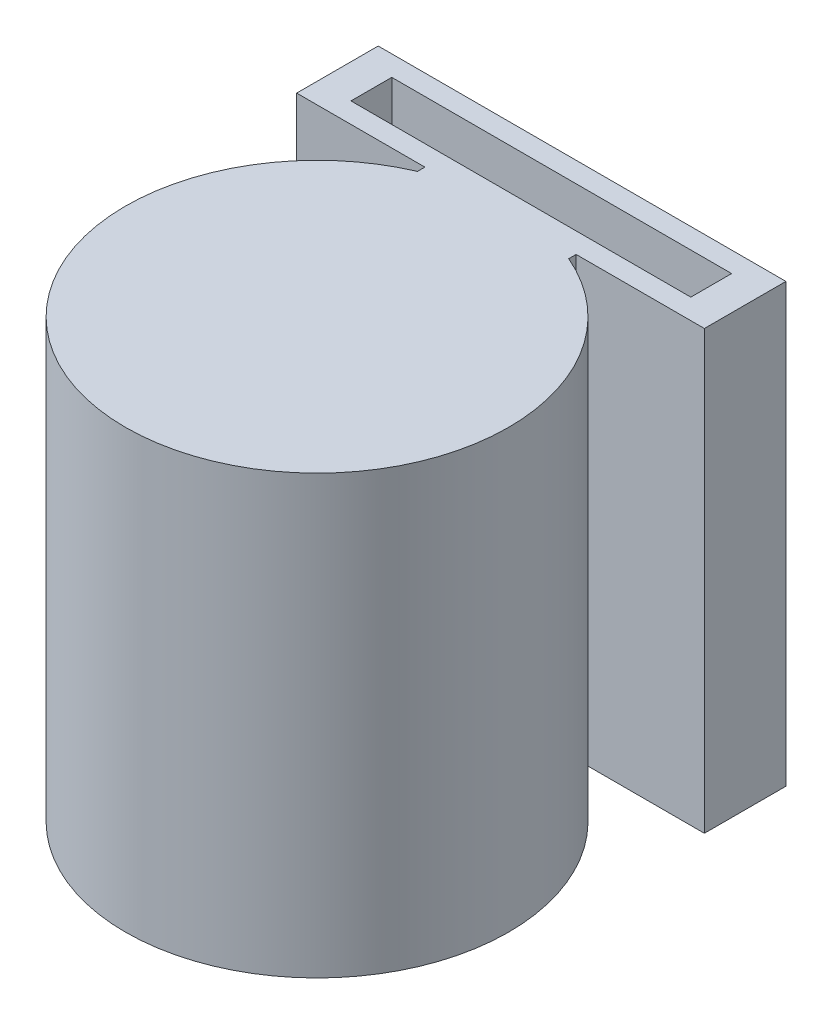
ISO-10303-21;
HEADER;
FILE_DESCRIPTION(('STEP AP214'),'2;1');
FILE_NAME('part.step','',(''),(''),'','','');
FILE_SCHEMA(('AUTOMOTIVE_DESIGN { 1 0 10303 214 1 1 1 1 }'));
ENDSEC;
DATA;
#1=APPLICATION_CONTEXT('core data for automotive mechanical design processes');
#2=APPLICATION_PROTOCOL_DEFINITION('international standard','automotive_design',2000,#1);
#3=PRODUCT_CONTEXT('',#1,'mechanical');
#4=PRODUCT('Part','Part','',(#3));
#5=PRODUCT_RELATED_PRODUCT_CATEGORY('part','',(#4));
#6=PRODUCT_DEFINITION_FORMATION('','',#4);
#7=PRODUCT_DEFINITION_CONTEXT('part definition',#1,'design');
#8=PRODUCT_DEFINITION('design','',#6,#7);
#9=PRODUCT_DEFINITION_SHAPE('','',#8);
#10=(LENGTH_UNIT() NAMED_UNIT(*) SI_UNIT(.MILLI.,.METRE.));
#11=(NAMED_UNIT(*) PLANE_ANGLE_UNIT() SI_UNIT($,.RADIAN.));
#12=(NAMED_UNIT(*) SI_UNIT($,.STERADIAN.) SOLID_ANGLE_UNIT());
#13=UNCERTAINTY_MEASURE_WITH_UNIT(LENGTH_MEASURE(1.E-05),#10,'distance_accuracy_value','');
#14=(GEOMETRIC_REPRESENTATION_CONTEXT(3) GLOBAL_UNCERTAINTY_ASSIGNED_CONTEXT((#13)) GLOBAL_UNIT_ASSIGNED_CONTEXT((#10,
#11,#12)) REPRESENTATION_CONTEXT('',''));
#15=CARTESIAN_POINT('',(0.,0.,0.));
#16=DIRECTION('',(0.,0.,1.));
#17=DIRECTION('',(1.,0.,0.));
#18=AXIS2_PLACEMENT_3D('',#15,#16,#17);
#19=CARTESIAN_POINT('',(0.,-72.0463985530224,-8.4996878151237));
#20=DIRECTION('',(0.,1.,0.));
#21=DIRECTION('',(0.,0.,1.));
#22=AXIS2_PLACEMENT_3D('',#19,#20,#21);
#23=CYLINDRICAL_SURFACE('',#22,13.1);
#24=CARTESIAN_POINT('',(0.,-13.5003121848763,-8.49968781512369));
#25=DIRECTION('',(0.,-0.707106781186549,-0.707106781186546));
#26=DIRECTION('',(0.,0.707106781186546,-0.707106781186549));
#27=AXIS2_PLACEMENT_3D('',#24,#25,#26);
#28=ELLIPSE('',#27,18.5261976670875,13.1);
#29=CARTESIAN_POINT('',(0.,-0.400312184876321,-21.5996878151237));
#30=VERTEX_POINT('',#29);
#31=EDGE_CURVE('E178',#30,#30,#28,.F.);
#32=ORIENTED_EDGE('',*,*,#31,.T.);
#33=EDGE_LOOP('',(#32));
#34=FACE_BOUND('',#33,.T.);
#35=CARTESIAN_POINT('',(0.,-32.17,-8.49968781512369));
#36=DIRECTION('',(0.,1.,0.));
#37=DIRECTION('',(0.,0.,1.));
#38=AXIS2_PLACEMENT_3D('',#35,#36,#37);
#39=CIRCLE('',#38,13.1);
#40=CARTESIAN_POINT('',(0.,-32.17,4.6003121848763));
#41=VERTEX_POINT('',#40);
#42=EDGE_CURVE('E173',#41,#41,#39,.F.);
#43=ORIENTED_EDGE('',*,*,#42,.T.);
#44=EDGE_LOOP('',(#43));
#45=FACE_BOUND('',#44,.T.);
#46=CARTESIAN_POINT('',(-5.,-17.33,-20.60794945749));
#47=CARTESIAN_POINT('',(-5.00000077299546,-17.4647773456957,-20.607948739692));
#48=CARTESIAN_POINT('',(-4.9945461523741,-17.5995444223365,-20.6102057827907));
#49=CARTESIAN_POINT('',(-4.97278621917224,-17.8680974508143,-20.6191571648665));
#50=CARTESIAN_POINT('',(-4.95647746997702,-18.0018830783386,-20.6258529092147));
#51=CARTESIAN_POINT('',(-4.91318889956214,-18.2673669819356,-20.6434565024935));
#52=CARTESIAN_POINT('',(-4.88621397751475,-18.3990661874963,-20.6543624175598));
#53=CARTESIAN_POINT('',(-4.82185442604891,-18.6595600603921,-20.6800375166632));
#54=CARTESIAN_POINT('',(-4.7844656666146,-18.7883535534012,-20.6948082332978));
#55=CARTESIAN_POINT('',(-4.6997496569164,-19.0417662998117,-20.7277051915014));
#56=CARTESIAN_POINT('',(-4.65245171248173,-19.1663966326081,-20.7458215202995));
#57=CARTESIAN_POINT('',(-4.54825389571227,-19.4111301803324,-20.7849017352215));
#58=CARTESIAN_POINT('',(-4.49135044450513,-19.5312316874058,-20.8058666821292));
#59=CARTESIAN_POINT('',(-4.30686065373591,-19.8836529451058,-20.8721587819417));
#60=CARTESIAN_POINT('',(-4.16543364831012,-20.1082712473746,-20.9209081415289));
#61=CARTESIAN_POINT('',(-3.84214834508918,-20.5416199812969,-21.0247836129367));
#62=CARTESIAN_POINT('',(-3.65870584283882,-20.7491124759798,-21.0801015024587));
#63=CARTESIAN_POINT('',(-3.25972286044259,-21.1313684093332,-21.1893224896178));
#64=CARTESIAN_POINT('',(-3.04417523214753,-21.3061245396978,-21.2432252690313));
#65=CARTESIAN_POINT('',(-2.69671701862042,-21.5428825268322,-21.3196936329052));
#66=CARTESIAN_POINT('',(-2.57453178361095,-21.6186491609927,-21.344847227288));
#67=CARTESIAN_POINT('',(-2.3237202457563,-21.7595574826825,-21.3925766406471));
#68=CARTESIAN_POINT('',(-2.1950965627914,-21.8247034466835,-21.4151534960578));
#69=CARTESIAN_POINT('',(-1.93224676155956,-21.9438110912984,-21.4570850818594));
#70=CARTESIAN_POINT('',(-1.79801981911725,-21.9977711195758,-21.4764393361391));
#71=CARTESIAN_POINT('',(-1.52500788719585,-22.0939565521357,-21.5113469202944));
#72=CARTESIAN_POINT('',(-1.38622510327827,-22.136187543632,-21.5269020594793));
#73=CARTESIAN_POINT('',(-1.11133159835551,-22.2069034577756,-21.553160852373));
#74=CARTESIAN_POINT('',(-0.975373196421513,-22.2359127134461,-21.5640482959931));
#75=CARTESIAN_POINT('',(-0.701301987739246,-22.2825232848404,-21.581622680507));
#76=CARTESIAN_POINT('',(-0.563190132791965,-22.3001295019587,-21.5883114260989));
#77=CARTESIAN_POINT('',(-0.285848621918882,-22.3237619664135,-21.5973035904533));
#78=CARTESIAN_POINT('',(-0.146619063337853,-22.3297892114485,-21.5996073870435));
#79=CARTESIAN_POINT('',(0.131857643638828,-22.3301998935752,-21.5997640848187));
#80=CARTESIAN_POINT('',(0.271104791342252,-22.3245836974394,-21.5976171262039));
#81=CARTESIAN_POINT('',(0.541359708999124,-22.3023592870198,-21.5891591362184));
#82=CARTESIAN_POINT('',(0.672422626751947,-22.2863317952921,-21.5830681495924));
#83=CARTESIAN_POINT('',(0.932689656740286,-22.2440083487516,-21.5670935980766));
#84=CARTESIAN_POINT('',(1.06189313306385,-22.2177089636883,-21.5572087662691));
#85=CARTESIAN_POINT('',(1.31747559716351,-22.1550972450327,-21.5339012726675));
#86=CARTESIAN_POINT('',(1.44385550047283,-22.118788209505,-21.5204797762278));
#87=CARTESIAN_POINT('',(1.69306621655445,-22.0364591356788,-21.4904264154263));
#88=CARTESIAN_POINT('',(1.81589565925142,-21.9904354040171,-21.4737933302783));
#89=CARTESIAN_POINT('',(2.05894589014105,-21.8883284118166,-21.4374638571149));
#90=CARTESIAN_POINT('',(2.17910418273138,-21.8321106051058,-21.417727033708));
#91=CARTESIAN_POINT('',(2.41426879492418,-21.7105086429354,-21.3758519125847));
#92=CARTESIAN_POINT('',(2.52927323917226,-21.6451211860412,-21.3537127505843));
#93=CARTESIAN_POINT('',(2.86554823973216,-21.4358764686924,-21.2844778396176));
#94=CARTESIAN_POINT('',(3.07824406504821,-21.2788677380166,-21.2345391276102));
#95=CARTESIAN_POINT('',(3.48784985545621,-20.9234581237548,-21.1287198933517));
#96=CARTESIAN_POINT('',(3.68303028020317,-20.7231298789938,-21.0726626704496));
#97=CARTESIAN_POINT('',(4.03778672498311,-20.2921029802661,-20.9632659334704));
#98=CARTESIAN_POINT('',(4.1973531296112,-20.0613961510735,-20.9099271563366));
#99=CARTESIAN_POINT('',(4.40816782560457,-19.6940459550784,-20.835967217222));
#100=CARTESIAN_POINT('',(4.47429739583672,-19.5663806876149,-20.8120732658062));
#101=CARTESIAN_POINT('',(4.59548194699221,-19.3054007288433,-20.7673573415251));
#102=CARTESIAN_POINT('',(4.65054164888725,-19.1720884753005,-20.7465340601242));
#103=CARTESIAN_POINT('',(4.74906656200108,-18.9007352062268,-20.7086663462666));
#104=CARTESIAN_POINT('',(4.79253222624607,-18.7626943756986,-20.6916217661652));
#105=CARTESIAN_POINT('',(4.86740009319177,-18.4829791527084,-20.6619261470531));
#106=CARTESIAN_POINT('',(4.89880827584683,-18.3413065987027,-20.6492729304284));
#107=CARTESIAN_POINT('',(4.94780228246284,-18.0634934438975,-20.6293997032522));
#108=CARTESIAN_POINT('',(4.9660677388611,-17.9274914545818,-20.621913525006));
#109=CARTESIAN_POINT('',(4.99135417821556,-17.6543267328377,-20.6115238525004));
#110=CARTESIAN_POINT('',(4.99838001788397,-17.5171645275172,-20.6086183788965));
#111=CARTESIAN_POINT('',(5.00112119561916,-17.2427128030691,-20.6074864995617));
#112=CARTESIAN_POINT('',(4.99683691642494,-17.1054232884069,-20.6092599354947));
#113=CARTESIAN_POINT('',(4.97700878311543,-16.8318029145489,-20.6174226430078));
#114=CARTESIAN_POINT('',(4.96146516358721,-16.6954720354398,-20.6238118184195));
#115=CARTESIAN_POINT('',(4.92034665278704,-16.4316082429433,-20.640554984866));
#116=CARTESIAN_POINT('',(4.89531397571543,-16.3039770092586,-20.6506940502698));
#117=CARTESIAN_POINT('',(4.83548895508767,-16.0513593845517,-20.674623993707));
#118=CARTESIAN_POINT('',(4.80069337033727,-15.9263738867344,-20.6884160844254));
#119=CARTESIAN_POINT('',(4.68210164901511,-15.5566453096703,-20.7346876182145));
#120=CARTESIAN_POINT('',(4.58406740980101,-15.3169203525938,-20.7720766434285));
#121=CARTESIAN_POINT('',(4.34869272081281,-14.8479821699037,-20.8574798641119));
#122=CARTESIAN_POINT('',(4.20998934249721,-14.6195243803918,-20.9058464767992));
#123=CARTESIAN_POINT('',(3.89865791596385,-14.1881393614822,-21.0071768118298));
#124=CARTESIAN_POINT('',(3.72601707097851,-13.9852218100054,-21.060142264034));
#125=CARTESIAN_POINT('',(3.33805830617867,-13.5967042217657,-21.1689575142761));
#126=CARTESIAN_POINT('',(3.12067387638251,-13.4131351496334,-21.2247665795372));
#127=CARTESIAN_POINT('',(2.77306630528949,-13.1670260129142,-21.3033717566487));
#128=CARTESIAN_POINT('',(2.65353387650317,-13.0898278394756,-21.328735158452));
#129=CARTESIAN_POINT('',(2.40797940352154,-12.945725317763,-21.3770809750498));
#130=CARTESIAN_POINT('',(2.28196016544225,-12.8788165675338,-21.4000644066455));
#131=CARTESIAN_POINT('',(2.02453051594954,-12.7559888043793,-21.4429591484642));
#132=CARTESIAN_POINT('',(1.89313271427099,-12.7000456875947,-21.4628771756344));
#133=CARTESIAN_POINT('',(1.625645419099,-12.5994948976204,-21.4991293008321));
#134=CARTESIAN_POINT('',(1.48955792384233,-12.5548824627227,-21.5154649039743));
#135=CARTESIAN_POINT('',(1.2136826370355,-12.4774236039433,-21.5440813032421));
#136=CARTESIAN_POINT('',(1.07389555440988,-12.4445749431381,-21.5563628702223));
#137=CARTESIAN_POINT('',(0.791706984322203,-12.3909898482652,-21.5765071143628));
#138=CARTESIAN_POINT('',(0.649305654529009,-12.3702526861955,-21.5843700571181));
#139=CARTESIAN_POINT('',(0.371712422044616,-12.3420039958122,-21.5951048118595));
#140=CARTESIAN_POINT('',(0.236604126895375,-12.3337697704292,-21.5982492224082));
#141=CARTESIAN_POINT('',(-0.0339162137791343,-12.3282845600324,-21.6003423810408));
#142=CARTESIAN_POINT('',(-0.169328346493468,-12.3310372860573,-21.599289711486));
#143=CARTESIAN_POINT('',(-0.43931815696781,-12.3475024280772,-21.5930152974894));
#144=CARTESIAN_POINT('',(-0.573896216301284,-12.3612093917681,-21.5877956271098));
#145=CARTESIAN_POINT('',(-0.841335343497229,-12.3994411530098,-21.5733291732026));
#146=CARTESIAN_POINT('',(-0.974195751505678,-12.4239699878237,-21.564080886755));
#147=CARTESIAN_POINT('',(-1.23372151816519,-12.4828195478416,-21.5420968049537));
#148=CARTESIAN_POINT('',(-1.36045780094682,-12.5168643112651,-21.5294596547101));
#149=CARTESIAN_POINT('',(-1.61054752299865,-12.5946736458941,-21.5009191715668));
#150=CARTESIAN_POINT('',(-1.73389975317985,-12.6384416415837,-21.4850146880741));
#151=CARTESIAN_POINT('',(-2.09765727952228,-12.7838062131564,-21.4329630652461));
#152=CARTESIAN_POINT('',(-2.33197748172777,-12.8995123816978,-21.3924586695733));
#153=CARTESIAN_POINT('',(-2.78811258040072,-13.1706789333167,-21.3017566611076));
#154=CARTESIAN_POINT('',(-3.00896652682937,-13.3276256163883,-21.2512190490947));
#155=CARTESIAN_POINT('',(-3.42219991575163,-13.674692089119,-21.1465836620575));
#156=CARTESIAN_POINT('',(-3.61456900895093,-13.8648238814023,-21.0924846033286));
#157=CARTESIAN_POINT('',(-3.88320612439718,-14.1770606528671,-21.0112889626748));
#158=CARTESIAN_POINT('',(-3.9714258763243,-14.2889309109974,-20.9834963896942));
#159=CARTESIAN_POINT('',(-4.138128247985,-14.5199895369802,-20.9292317230456));
#160=CARTESIAN_POINT('',(-4.21661437030076,-14.6391752492004,-20.9027591564443));
#161=CARTESIAN_POINT('',(-4.36332629746971,-14.884228781238,-20.8519112245961));
#162=CARTESIAN_POINT('',(-4.43154565919872,-15.0101007306687,-20.8275371803928));
#163=CARTESIAN_POINT('',(-4.55708856638571,-15.2676105106213,-20.7816831214762));
#164=CARTESIAN_POINT('',(-4.61441671200002,-15.3992458777935,-20.7602018860395));
#165=CARTESIAN_POINT('',(-4.72078520609763,-15.6754955463996,-20.7196561117436));
#166=CARTESIAN_POINT('',(-4.7691217724347,-15.8204146718544,-20.7008139509207));
#167=CARTESIAN_POINT('',(-4.85241561712353,-16.1145131698608,-20.6679280697413));
#168=CARTESIAN_POINT('',(-4.88737900503078,-16.2636905634621,-20.6538821585266));
#169=CARTESIAN_POINT('',(-4.94350110321208,-16.5649721380047,-20.6311640676757));
#170=CARTESIAN_POINT('',(-4.96466480217716,-16.7170752407857,-20.6224899461542));
#171=CARTESIAN_POINT('',(-4.99291283011622,-17.0227901501697,-20.6108834497285));
#172=CARTESIAN_POINT('',(-4.99999911906001,-17.1764017437553,-20.6079502755246));
#173=CARTESIAN_POINT('',(-5.,-17.33,-20.60794945749));
#174=B_SPLINE_CURVE_WITH_KNOTS('',3,(#46,#47,#48,#49,#50,#51,#52,#53,#54,#55,#56,#57,#58,#59,
#60,#61,#62,#63,#64,#65,#66,#67,#68,#69,#70,#71,#72,#73,#74,#75,#76,#77,#78,#79,#80,#81,#82,#83,
#84,#85,#86,#87,#88,#89,#90,#91,#92,#93,#94,#95,#96,#97,#98,#99,#100,#101,#102,#103,#104,#105,
#106,#107,#108,#109,#110,#111,#112,#113,#114,#115,#116,#117,#118,#119,#120,#121,#122,#123,#124,
#125,#126,#127,#128,#129,#130,#131,#132,#133,#134,#135,#136,#137,#138,#139,#140,#141,#142,#143,
#144,#145,#146,#147,#148,#149,#150,#151,#152,#153,#154,#155,#156,#157,#158,#159,#160,#161,#162,
#163,#164,#165,#166,#167,#168,#169,#170,#171,#172,#173),.UNSPECIFIED.,.T.,.F.,(4,2,2,2,2,2,2,2,
2,2,2,2,2,2,2,2,2,2,2,2,2,2,2,2,2,2,2,2,2,2,2,2,2,2,2,2,2,2,2,2,2,2,2,2,2,2,2,2,2,2,2,2,2,2,2,2,
2,2,2,2,2,2,2,4),(0.,0.404185877193878,0.808499787914935,1.21262820503349,1.61691712390312,
2.0200268468486,2.42328709547808,3.22923395549903,4.07295187284563,4.91685792406972,
5.35426297945339,5.7914914739321,6.22878450790019,6.66586887540024,7.08366636577154,
7.50128415388613,7.91886595648123,8.33643460530516,8.73250792181314,9.12871361839157,
9.52478892546036,9.92101508576416,10.3229120978595,10.7249541819643,11.528506152788,
12.3805951032325,13.2329138310441,13.6696938547756,14.1062872077572,14.5428634987612,
14.9792229874875,15.3909735168494,15.802546077999,16.2141047115452,16.6256547705609,
17.0165636990743,17.4076025595751,18.1890492783477,19.0004575101389,19.8121722877572,
20.6775356659066,21.1107145677751,21.543707631154,21.9757379760814,22.4075864591345,
22.8393527810021,23.2710931474429,23.6767756733167,24.0825952372927,24.488212936498,
24.8939820856565,25.2890257453013,25.6842087589665,26.4739212627638,27.2973481707653,
28.1210735211301,28.5561109775409,28.9909914315558,29.4261436760778,29.8611117133863,
30.3221816468468,30.7830406875463,31.2437330317423,31.7043612301628),.UNSPECIFIED.);
#175=CARTESIAN_POINT('',(-5.,-17.33,-20.60794945749));
#176=VERTEX_POINT('',#175);
#177=EDGE_CURVE('E36',#176,#176,#174,.T.);
#178=ORIENTED_EDGE('',*,*,#177,.F.);
#179=EDGE_LOOP('',(#178));
#180=FACE_BOUND('',#179,.T.);
#181=ADVANCED_FACE('F32',(#34,#45,#180),#23,.F.);
#182=CARTESIAN_POINT('',(0.,-72.0463985530224,-8.4996878151237));
#183=DIRECTION('',(0.,1.,0.));
#184=DIRECTION('',(0.,0.,1.));
#185=AXIS2_PLACEMENT_3D('',#182,#183,#184);
#186=CYLINDRICAL_SURFACE('',#185,14.0984359130698);
#187=DIRECTION('',(0.,1.,0.));
#188=VECTOR('',#187,1.);
#189=CARTESIAN_POINT('',(5.56293811247676,-32.17,-21.4542088310351));
#190=LINE('',#189,#188);
#191=CARTESIAN_POINT('',(5.56293811247676,-32.17,-21.4542088310351));
#192=VERTEX_POINT('',#191);
#193=CARTESIAN_POINT('',(5.56293811247676,0.,-21.4542088310351));
#194=VERTEX_POINT('',#193);
#195=EDGE_CURVE('E150',#192,#194,#190,.T.);
#196=ORIENTED_EDGE('',*,*,#195,.T.);
#197=CARTESIAN_POINT('',(0.,0.,-8.49968781512369));
#198=DIRECTION('',(0.,1.,0.));
#199=DIRECTION('',(0.,0.,1.));
#200=AXIS2_PLACEMENT_3D('',#197,#198,#199);
#201=CIRCLE('',#200,14.0984359130698);
#202=CARTESIAN_POINT('',(-5.56293811247676,0.,-21.4542088310351));
#203=VERTEX_POINT('',#202);
#204=EDGE_CURVE('E174',#203,#194,#201,.T.);
#205=ORIENTED_EDGE('',*,*,#204,.F.);
#206=DIRECTION('',(0.,1.,0.));
#207=VECTOR('',#206,1.);
#208=CARTESIAN_POINT('',(-5.56293811247676,-32.17,-21.4542088310351));
#209=LINE('',#208,#207);
#210=CARTESIAN_POINT('',(-5.56293811247676,-32.17,-21.4542088310351));
#211=VERTEX_POINT('',#210);
#212=EDGE_CURVE('E172',#211,#203,#209,.T.);
#213=ORIENTED_EDGE('',*,*,#212,.F.);
#214=CARTESIAN_POINT('',(0.,-32.17,-8.49968781512369));
#215=DIRECTION('',(0.,1.,0.));
#216=DIRECTION('',(0.,0.,1.));
#217=AXIS2_PLACEMENT_3D('',#214,#215,#216);
#218=CIRCLE('',#217,14.0984359130698);
#219=EDGE_CURVE('E165',#192,#211,#218,.F.);
#220=ORIENTED_EDGE('',*,*,#219,.F.);
#221=EDGE_LOOP('',(#196,#205,#213,#220));
#222=FACE_BOUND('',#221,.T.);
#223=ADVANCED_FACE('F171',(#222),#186,.T.);
#224=CARTESIAN_POINT('',(-15.,-32.17,-22.));
#225=DIRECTION('',(0.,0.,1.));
#226=DIRECTION('',(1.,0.,0.));
#227=AXIS2_PLACEMENT_3D('',#224,#225,#226);
#228=PLANE('',#227);
#229=DIRECTION('',(0.,1.,0.));
#230=VECTOR('',#229,1.);
#231=CARTESIAN_POINT('',(5.56293811247676,-32.17,-22.));
#232=LINE('',#231,#230);
#233=CARTESIAN_POINT('',(5.56293811247676,-32.17,-22.));
#234=VERTEX_POINT('',#233);
#235=CARTESIAN_POINT('',(5.56293811247675,0.,-22.));
#236=VERTEX_POINT('',#235);
#237=EDGE_CURVE('E158',#234,#236,#232,.T.);
#238=ORIENTED_EDGE('',*,*,#237,.F.);
#239=DIRECTION('',(1.,0.,0.));
#240=VECTOR('',#239,1.);
#241=CARTESIAN_POINT('',(-15.,-32.17,-22.));
#242=LINE('',#241,#240);
#243=CARTESIAN_POINT('',(15.,-32.17,-22.));
#244=VERTEX_POINT('',#243);
#245=EDGE_CURVE('E168',#234,#244,#242,.T.);
#246=ORIENTED_EDGE('',*,*,#245,.T.);
#247=DIRECTION('',(0.,1.,0.));
#248=VECTOR('',#247,1.);
#249=CARTESIAN_POINT('',(15.,-32.17,-22.));
#250=LINE('',#249,#248);
#251=CARTESIAN_POINT('',(15.,0.,-22.));
#252=VERTEX_POINT('',#251);
#253=EDGE_CURVE('E45',#244,#252,#250,.T.);
#254=ORIENTED_EDGE('',*,*,#253,.T.);
#255=DIRECTION('',(1.,0.,0.));
#256=VECTOR('',#255,1.);
#257=CARTESIAN_POINT('',(-15.,0.,-22.));
#258=LINE('',#257,#256);
#259=EDGE_CURVE('E263',#236,#252,#258,.T.);
#260=ORIENTED_EDGE('',*,*,#259,.F.);
#261=EDGE_LOOP('',(#238,#246,#254,#260));
#262=FACE_BOUND('',#261,.T.);
#263=ADVANCED_FACE('F299',(#262),#228,.T.);
#264=CARTESIAN_POINT('',(15.,-32.17,-28.));
#265=DIRECTION('',(0.,0.,-1.));
#266=DIRECTION('',(-1.,0.,0.));
#267=AXIS2_PLACEMENT_3D('',#264,#265,#266);
#268=PLANE('',#267);
#269=DIRECTION('',(0.,1.,0.));
#270=VECTOR('',#269,1.);
#271=CARTESIAN_POINT('',(-12.5,-5.16615827568478,-28.));
#272=LINE('',#271,#270);
#273=CARTESIAN_POINT('',(-12.5,-30.17,-28.));
#274=VERTEX_POINT('',#273);
#275=CARTESIAN_POINT('',(-12.5,-5.16615827568478,-28.));
#276=VERTEX_POINT('',#275);
#277=EDGE_CURVE('E61',#274,#276,#272,.T.);
#278=ORIENTED_EDGE('',*,*,#277,.F.);
#279=DIRECTION('',(-1.,0.,0.));
#280=VECTOR('',#279,1.);
#281=CARTESIAN_POINT('',(-12.5,-30.17,-28.));
#282=LINE('',#281,#280);
#283=CARTESIAN_POINT('',(12.5,-30.17,-28.));
#284=VERTEX_POINT('',#283);
#285=EDGE_CURVE('E200',#284,#274,#282,.T.);
#286=ORIENTED_EDGE('',*,*,#285,.F.);
#287=DIRECTION('',(0.,-1.,0.));
#288=VECTOR('',#287,1.);
#289=CARTESIAN_POINT('',(12.5,-5.16615827568478,-28.));
#290=LINE('',#289,#288);
#291=CARTESIAN_POINT('',(12.5,-5.16615827568478,-28.));
#292=VERTEX_POINT('',#291);
#293=EDGE_CURVE('E197',#292,#284,#290,.T.);
#294=ORIENTED_EDGE('',*,*,#293,.F.);
#295=DIRECTION('',(1.,0.,0.));
#296=VECTOR('',#295,1.);
#297=CARTESIAN_POINT('',(-12.5,-5.16615827568478,-28.));
#298=LINE('',#297,#296);
#299=EDGE_CURVE('E194',#276,#292,#298,.T.);
#300=ORIENTED_EDGE('',*,*,#299,.F.);
#301=EDGE_LOOP('',(#278,#286,#294,#300));
#302=FACE_BOUND('',#301,.T.);
#303=DIRECTION('',(-1.,0.,0.));
#304=VECTOR('',#303,1.);
#305=CARTESIAN_POINT('',(15.,0.,-28.));
#306=LINE('',#305,#304);
#307=CARTESIAN_POINT('',(15.,0.,-28.));
#308=VERTEX_POINT('',#307);
#309=CARTESIAN_POINT('',(-15.,0.,-28.));
#310=VERTEX_POINT('',#309);
#311=EDGE_CURVE('E237',#308,#310,#306,.T.);
#312=ORIENTED_EDGE('',*,*,#311,.F.);
#313=DIRECTION('',(0.,1.,0.));
#314=VECTOR('',#313,1.);
#315=CARTESIAN_POINT('',(15.,-32.17,-28.));
#316=LINE('',#315,#314);
#317=CARTESIAN_POINT('',(15.,-32.17,-28.));
#318=VERTEX_POINT('',#317);
#319=EDGE_CURVE('E11',#318,#308,#316,.T.);
#320=ORIENTED_EDGE('',*,*,#319,.F.);
#321=DIRECTION('',(-1.,0.,0.));
#322=VECTOR('',#321,1.);
#323=CARTESIAN_POINT('',(15.,-32.17,-28.));
#324=LINE('',#323,#322);
#325=CARTESIAN_POINT('',(-15.,-32.17,-28.));
#326=VERTEX_POINT('',#325);
#327=EDGE_CURVE('E244',#318,#326,#324,.T.);
#328=ORIENTED_EDGE('',*,*,#327,.T.);
#329=DIRECTION('',(0.,1.,0.));
#330=VECTOR('',#329,1.);
#331=CARTESIAN_POINT('',(-15.,-32.17,-28.));
#332=LINE('',#331,#330);
#333=EDGE_CURVE('E257',#326,#310,#332,.T.);
#334=ORIENTED_EDGE('',*,*,#333,.T.);
#335=EDGE_LOOP('',(#312,#320,#328,#334));
#336=FACE_BOUND('',#335,.T.);
#337=ADVANCED_FACE('F34',(#302,#336),#268,.T.);
#338=CARTESIAN_POINT('',(15.,-32.17,-22.));
#339=DIRECTION('',(1.,0.,0.));
#340=DIRECTION('',(0.,0.,-1.));
#341=AXIS2_PLACEMENT_3D('',#338,#339,#340);
#342=PLANE('',#341);
#343=DIRECTION('',(0.,0.,-1.));
#344=VECTOR('',#343,1.);
#345=CARTESIAN_POINT('',(15.,0.,-22.));
#346=LINE('',#345,#344);
#347=EDGE_CURVE('E248',#252,#308,#346,.T.);
#348=ORIENTED_EDGE('',*,*,#347,.F.);
#349=ORIENTED_EDGE('',*,*,#253,.F.);
#350=DIRECTION('',(0.,0.,-1.));
#351=VECTOR('',#350,1.);
#352=CARTESIAN_POINT('',(15.,-32.17,-22.));
#353=LINE('',#352,#351);
#354=EDGE_CURVE('E254',#244,#318,#353,.T.);
#355=ORIENTED_EDGE('',*,*,#354,.T.);
#356=ORIENTED_EDGE('',*,*,#319,.T.);
#357=EDGE_LOOP('',(#348,#349,#355,#356));
#358=FACE_BOUND('',#357,.T.);
#359=ADVANCED_FACE('F343',(#358),#342,.T.);
#360=DIRECTION('',(0.,1.,0.));
#361=VECTOR('',#360,1.);
#362=CARTESIAN_POINT('',(-5.56293811247676,-32.17,-22.));
#363=LINE('',#362,#361);
#364=CARTESIAN_POINT('',(-5.56293811247676,-32.17,-22.));
#365=VERTEX_POINT('',#364);
#366=CARTESIAN_POINT('',(-5.56293811247676,0.,-22.));
#367=VERTEX_POINT('',#366);
#368=EDGE_CURVE('E181',#365,#367,#363,.T.);
#369=ORIENTED_EDGE('',*,*,#368,.T.);
#370=CARTESIAN_POINT('',(-15.,0.,-22.));
#371=VERTEX_POINT('',#370);
#372=EDGE_CURVE('E264',#371,#367,#258,.T.);
#373=ORIENTED_EDGE('',*,*,#372,.F.);
#374=DIRECTION('',(0.,1.,0.));
#375=VECTOR('',#374,1.);
#376=CARTESIAN_POINT('',(-15.,-32.17,-22.));
#377=LINE('',#376,#375);
#378=CARTESIAN_POINT('',(-15.,-32.17,-22.));
#379=VERTEX_POINT('',#378);
#380=EDGE_CURVE('E271',#379,#371,#377,.T.);
#381=ORIENTED_EDGE('',*,*,#380,.F.);
#382=EDGE_CURVE('E251',#379,#365,#242,.T.);
#383=ORIENTED_EDGE('',*,*,#382,.T.);
#384=EDGE_LOOP('',(#369,#373,#381,#383));
#385=FACE_BOUND('',#384,.T.);
#386=ADVANCED_FACE('F346',(#385),#228,.T.);
#387=CARTESIAN_POINT('',(-15.,-32.17,-28.));
#388=DIRECTION('',(-1.,0.,0.));
#389=DIRECTION('',(0.,0.,1.));
#390=AXIS2_PLACEMENT_3D('',#387,#388,#389);
#391=PLANE('',#390);
#392=DIRECTION('',(0.,0.,1.));
#393=VECTOR('',#392,1.);
#394=CARTESIAN_POINT('',(-15.,0.,-28.));
#395=LINE('',#394,#393);
#396=EDGE_CURVE('E260',#310,#371,#395,.T.);
#397=ORIENTED_EDGE('',*,*,#396,.F.);
#398=ORIENTED_EDGE('',*,*,#333,.F.);
#399=DIRECTION('',(0.,0.,1.));
#400=VECTOR('',#399,1.);
#401=CARTESIAN_POINT('',(-15.,-32.17,-28.));
#402=LINE('',#401,#400);
#403=EDGE_CURVE('E247',#326,#379,#402,.T.);
#404=ORIENTED_EDGE('',*,*,#403,.T.);
#405=ORIENTED_EDGE('',*,*,#380,.T.);
#406=EDGE_LOOP('',(#397,#398,#404,#405));
#407=FACE_BOUND('',#406,.T.);
#408=ADVANCED_FACE('F340',(#407),#391,.T.);
#409=CARTESIAN_POINT('',(0.,-32.17,0.));
#410=DIRECTION('',(0.,1.,0.));
#411=DIRECTION('',(0.,0.,1.));
#412=AXIS2_PLACEMENT_3D('',#409,#410,#411);
#413=PLANE('',#412);
#414=DIRECTION('',(0.,0.,-1.));
#415=VECTOR('',#414,1.);
#416=CARTESIAN_POINT('',(5.56293811247676,-32.17,-21.4542088310351));
#417=LINE('',#416,#415);
#418=EDGE_CURVE('E153',#192,#234,#417,.T.);
#419=ORIENTED_EDGE('',*,*,#418,.F.);
#420=ORIENTED_EDGE('',*,*,#219,.T.);
#421=DIRECTION('',(0.,0.,1.));
#422=VECTOR('',#421,1.);
#423=CARTESIAN_POINT('',(-5.56293811247676,-32.17,-22.));
#424=LINE('',#423,#422);
#425=EDGE_CURVE('E279',#365,#211,#424,.T.);
#426=ORIENTED_EDGE('',*,*,#425,.F.);
#427=ORIENTED_EDGE('',*,*,#382,.F.);
#428=ORIENTED_EDGE('',*,*,#403,.F.);
#429=ORIENTED_EDGE('',*,*,#327,.F.);
#430=ORIENTED_EDGE('',*,*,#354,.F.);
#431=ORIENTED_EDGE('',*,*,#245,.F.);
#432=EDGE_LOOP('',(#419,#420,#426,#427,#428,#429,#430,#431));
#433=FACE_BOUND('',#432,.T.);
#434=DIRECTION('',(0.,0.,-1.));
#435=VECTOR('',#434,1.);
#436=CARTESIAN_POINT('',(12.5030002593994,-32.17,-23.4979991912842));
#437=LINE('',#436,#435);
#438=CARTESIAN_POINT('',(12.5030002593994,-32.17,-23.4979991912842));
#439=VERTEX_POINT('',#438);
#440=CARTESIAN_POINT('',(12.5030002593994,-32.17,-26.5020008087158));
#441=VERTEX_POINT('',#440);
#442=EDGE_CURVE('E222',#439,#441,#437,.T.);
#443=ORIENTED_EDGE('',*,*,#442,.T.);
#444=DIRECTION('',(-1.,0.,0.));
#445=VECTOR('',#444,1.);
#446=CARTESIAN_POINT('',(12.5030002593994,-32.17,-26.5020008087158));
#447=LINE('',#446,#445);
#448=CARTESIAN_POINT('',(-12.5030002593994,-32.17,-26.5020008087158));
#449=VERTEX_POINT('',#448);
#450=EDGE_CURVE('E212',#441,#449,#447,.T.);
#451=ORIENTED_EDGE('',*,*,#450,.T.);
#452=DIRECTION('',(0.,0.,1.));
#453=VECTOR('',#452,1.);
#454=CARTESIAN_POINT('',(-12.5030002593994,-32.17,-26.5020008087158));
#455=LINE('',#454,#453);
#456=CARTESIAN_POINT('',(-12.5030002593994,-32.17,-23.4979991912842));
#457=VERTEX_POINT('',#456);
#458=EDGE_CURVE('E215',#449,#457,#455,.T.);
#459=ORIENTED_EDGE('',*,*,#458,.T.);
#460=DIRECTION('',(1.,0.,0.));
#461=VECTOR('',#460,1.);
#462=CARTESIAN_POINT('',(-12.5030002593994,-32.17,-23.4979991912842));
#463=LINE('',#462,#461);
#464=EDGE_CURVE('E219',#457,#439,#463,.T.);
#465=ORIENTED_EDGE('',*,*,#464,.T.);
#466=EDGE_LOOP('',(#443,#451,#459,#465));
#467=FACE_BOUND('',#466,.T.);
#468=ORIENTED_EDGE('',*,*,#42,.F.);
#469=EDGE_LOOP('',(#468));
#470=FACE_BOUND('',#469,.T.);
#471=ADVANCED_FACE('F162',(#433,#467,#470),#413,.F.);
#472=CARTESIAN_POINT('',(0.,0.,0.));
#473=DIRECTION('',(0.,1.,0.));
#474=DIRECTION('',(0.,0.,1.));
#475=AXIS2_PLACEMENT_3D('',#472,#473,#474);
#476=PLANE('',#475);
#477=ORIENTED_EDGE('',*,*,#204,.T.);
#478=DIRECTION('',(0.,0.,-1.));
#479=VECTOR('',#478,1.);
#480=CARTESIAN_POINT('',(5.56293811247676,0.,-21.4542088310351));
#481=LINE('',#480,#479);
#482=EDGE_CURVE('E53',#194,#236,#481,.T.);
#483=ORIENTED_EDGE('',*,*,#482,.T.);
#484=ORIENTED_EDGE('',*,*,#259,.T.);
#485=ORIENTED_EDGE('',*,*,#347,.T.);
#486=ORIENTED_EDGE('',*,*,#311,.T.);
#487=ORIENTED_EDGE('',*,*,#396,.T.);
#488=ORIENTED_EDGE('',*,*,#372,.T.);
#489=DIRECTION('',(0.,0.,1.));
#490=VECTOR('',#489,1.);
#491=CARTESIAN_POINT('',(-5.56293811247676,0.,-22.));
#492=LINE('',#491,#490);
#493=EDGE_CURVE('E281',#367,#203,#492,.T.);
#494=ORIENTED_EDGE('',*,*,#493,.T.);
#495=EDGE_LOOP('',(#477,#483,#484,#485,#486,#487,#488,#494));
#496=FACE_BOUND('',#495,.T.);
#497=DIRECTION('',(-1.,0.,0.));
#498=VECTOR('',#497,1.);
#499=CARTESIAN_POINT('',(12.5030002593994,0.,-26.5020008087158));
#500=LINE('',#499,#498);
#501=CARTESIAN_POINT('',(12.5030002593994,0.,-26.5020008087158));
#502=VERTEX_POINT('',#501);
#503=CARTESIAN_POINT('',(-12.5030002593994,0.,-26.5020008087158));
#504=VERTEX_POINT('',#503);
#505=EDGE_CURVE('E211',#502,#504,#500,.T.);
#506=ORIENTED_EDGE('',*,*,#505,.F.);
#507=DIRECTION('',(0.,0.,-1.));
#508=VECTOR('',#507,1.);
#509=CARTESIAN_POINT('',(12.5030002593994,0.,-23.4979991912842));
#510=LINE('',#509,#508);
#511=CARTESIAN_POINT('',(12.5030002593994,0.,-23.4979991912842));
#512=VERTEX_POINT('',#511);
#513=EDGE_CURVE('E216',#512,#502,#510,.T.);
#514=ORIENTED_EDGE('',*,*,#513,.F.);
#515=DIRECTION('',(1.,0.,0.));
#516=VECTOR('',#515,1.);
#517=CARTESIAN_POINT('',(-12.5030002593994,0.,-23.4979991912842));
#518=LINE('',#517,#516);
#519=CARTESIAN_POINT('',(-12.5030002593994,0.,-23.4979991912842));
#520=VERTEX_POINT('',#519);
#521=EDGE_CURVE('E230',#520,#512,#518,.T.);
#522=ORIENTED_EDGE('',*,*,#521,.F.);
#523=DIRECTION('',(0.,0.,1.));
#524=VECTOR('',#523,1.);
#525=CARTESIAN_POINT('',(-12.5030002593994,0.,-26.5020008087158));
#526=LINE('',#525,#524);
#527=EDGE_CURVE('E227',#504,#520,#526,.T.);
#528=ORIENTED_EDGE('',*,*,#527,.F.);
#529=EDGE_LOOP('',(#506,#514,#522,#528));
#530=FACE_BOUND('',#529,.T.);
#531=ADVANCED_FACE('F336',(#496,#530),#476,.T.);
#532=CARTESIAN_POINT('',(12.5030002593994,-32.17,-26.5020008087158));
#533=DIRECTION('',(0.,0.,-1.));
#534=DIRECTION('',(-1.,0.,0.));
#535=AXIS2_PLACEMENT_3D('',#532,#533,#534);
#536=PLANE('',#535);
#537=DIRECTION('',(1.,0.,0.));
#538=VECTOR('',#537,1.);
#539=CARTESIAN_POINT('',(-12.5,-30.17,-26.5020008087158));
#540=LINE('',#539,#538);
#541=CARTESIAN_POINT('',(-12.5,-30.17,-26.5020008087158));
#542=VERTEX_POINT('',#541);
#543=CARTESIAN_POINT('',(12.5,-30.17,-26.5020008087158));
#544=VERTEX_POINT('',#543);
#545=EDGE_CURVE('E187',#542,#544,#540,.T.);
#546=ORIENTED_EDGE('',*,*,#545,.F.);
#547=DIRECTION('',(0.,-1.,0.));
#548=VECTOR('',#547,1.);
#549=CARTESIAN_POINT('',(-12.5,-5.16615827568478,-26.5020008087158));
#550=LINE('',#549,#548);
#551=CARTESIAN_POINT('',(-12.5,-5.16615827568478,-26.5020008087158));
#552=VERTEX_POINT('',#551);
#553=EDGE_CURVE('E190',#552,#542,#550,.T.);
#554=ORIENTED_EDGE('',*,*,#553,.F.);
#555=DIRECTION('',(-1.,0.,0.));
#556=VECTOR('',#555,1.);
#557=CARTESIAN_POINT('',(-12.5,-5.16615827568478,-26.5020008087158));
#558=LINE('',#557,#556);
#559=CARTESIAN_POINT('',(12.5,-5.16615827568478,-26.5020008087158));
#560=VERTEX_POINT('',#559);
#561=EDGE_CURVE('E192',#560,#552,#558,.T.);
#562=ORIENTED_EDGE('',*,*,#561,.F.);
#563=DIRECTION('',(0.,1.,0.));
#564=VECTOR('',#563,1.);
#565=CARTESIAN_POINT('',(12.5,-5.16615827568478,-26.5020008087158));
#566=LINE('',#565,#564);
#567=EDGE_CURVE('E184',#544,#560,#566,.T.);
#568=ORIENTED_EDGE('',*,*,#567,.F.);
#569=EDGE_LOOP('',(#546,#554,#562,#568));
#570=FACE_BOUND('',#569,.T.);
#571=ORIENTED_EDGE('',*,*,#505,.T.);
#572=DIRECTION('',(0.,1.,0.));
#573=VECTOR('',#572,1.);
#574=CARTESIAN_POINT('',(-12.5030002593994,-32.17,-26.5020008087158));
#575=LINE('',#574,#573);
#576=EDGE_CURVE('E225',#449,#504,#575,.T.);
#577=ORIENTED_EDGE('',*,*,#576,.F.);
#578=ORIENTED_EDGE('',*,*,#450,.F.);
#579=DIRECTION('',(0.,1.,0.));
#580=VECTOR('',#579,1.);
#581=CARTESIAN_POINT('',(12.5030002593994,-32.17,-26.5020008087158));
#582=LINE('',#581,#580);
#583=EDGE_CURVE('E235',#441,#502,#582,.T.);
#584=ORIENTED_EDGE('',*,*,#583,.T.);
#585=EDGE_LOOP('',(#571,#577,#578,#584));
#586=FACE_BOUND('',#585,.T.);
#587=ADVANCED_FACE('F327',(#570,#586),#536,.F.);
#588=CARTESIAN_POINT('',(12.5030002593994,-32.17,-23.4979991912842));
#589=DIRECTION('',(1.,0.,0.));
#590=DIRECTION('',(0.,0.,-1.));
#591=AXIS2_PLACEMENT_3D('',#588,#589,#590);
#592=PLANE('',#591);
#593=ORIENTED_EDGE('',*,*,#513,.T.);
#594=ORIENTED_EDGE('',*,*,#583,.F.);
#595=ORIENTED_EDGE('',*,*,#442,.F.);
#596=DIRECTION('',(0.,1.,0.));
#597=VECTOR('',#596,1.);
#598=CARTESIAN_POINT('',(12.5030002593994,-32.17,-23.4979991912842));
#599=LINE('',#598,#597);
#600=EDGE_CURVE('E238',#439,#512,#599,.T.);
#601=ORIENTED_EDGE('',*,*,#600,.T.);
#602=EDGE_LOOP('',(#593,#594,#595,#601));
#603=FACE_BOUND('',#602,.T.);
#604=ADVANCED_FACE('F323',(#603),#592,.F.);
#605=CARTESIAN_POINT('',(-12.5030002593994,-32.17,-23.4979991912842));
#606=DIRECTION('',(0.,0.,1.));
#607=DIRECTION('',(1.,0.,0.));
#608=AXIS2_PLACEMENT_3D('',#605,#606,#607);
#609=PLANE('',#608);
#610=CARTESIAN_POINT('',(0.,-17.33,-23.4979991912842));
#611=DIRECTION('',(0.,0.,1.));
#612=DIRECTION('',(1.,0.,0.));
#613=AXIS2_PLACEMENT_3D('',#610,#611,#612);
#614=CIRCLE('',#613,5.);
#615=CARTESIAN_POINT('',(5.,-17.33,-23.4979991912842));
#616=VERTEX_POINT('',#615);
#617=EDGE_CURVE('E286',#616,#616,#614,.T.);
#618=ORIENTED_EDGE('',*,*,#617,.T.);
#619=EDGE_LOOP('',(#618));
#620=FACE_BOUND('',#619,.T.);
#621=ORIENTED_EDGE('',*,*,#521,.T.);
#622=ORIENTED_EDGE('',*,*,#600,.F.);
#623=ORIENTED_EDGE('',*,*,#464,.F.);
#624=DIRECTION('',(0.,1.,0.));
#625=VECTOR('',#624,1.);
#626=CARTESIAN_POINT('',(-12.5030002593994,-32.17,-23.4979991912842));
#627=LINE('',#626,#625);
#628=EDGE_CURVE('E240',#457,#520,#627,.T.);
#629=ORIENTED_EDGE('',*,*,#628,.T.);
#630=EDGE_LOOP('',(#621,#622,#623,#629));
#631=FACE_BOUND('',#630,.T.);
#632=ADVANCED_FACE('F326',(#620,#631),#609,.F.);
#633=CARTESIAN_POINT('',(-12.5030002593994,-32.17,-26.5020008087158));
#634=DIRECTION('',(-1.,0.,0.));
#635=DIRECTION('',(0.,0.,1.));
#636=AXIS2_PLACEMENT_3D('',#633,#634,#635);
#637=PLANE('',#636);
#638=ORIENTED_EDGE('',*,*,#527,.T.);
#639=ORIENTED_EDGE('',*,*,#628,.F.);
#640=ORIENTED_EDGE('',*,*,#458,.F.);
#641=ORIENTED_EDGE('',*,*,#576,.T.);
#642=EDGE_LOOP('',(#638,#639,#640,#641));
#643=FACE_BOUND('',#642,.T.);
#644=ADVANCED_FACE('F322',(#643),#637,.F.);
#645=CARTESIAN_POINT('',(-12.5,-5.16615827568478,8.85605486427908));
#646=DIRECTION('',(-1.,0.,0.));
#647=DIRECTION('',(0.,0.,1.));
#648=AXIS2_PLACEMENT_3D('',#645,#646,#647);
#649=PLANE('',#648);
#650=ORIENTED_EDGE('',*,*,#553,.T.);
#651=DIRECTION('',(0.,0.,-1.));
#652=VECTOR('',#651,1.);
#653=CARTESIAN_POINT('',(-12.5,-30.17,8.85605486427908));
#654=LINE('',#653,#652);
#655=EDGE_CURVE('E188',#542,#274,#654,.T.);
#656=ORIENTED_EDGE('',*,*,#655,.T.);
#657=ORIENTED_EDGE('',*,*,#277,.T.);
#658=DIRECTION('',(0.,0.,-1.));
#659=VECTOR('',#658,1.);
#660=CARTESIAN_POINT('',(-12.5,-5.16615827568478,8.85605486427908));
#661=LINE('',#660,#659);
#662=EDGE_CURVE('E203',#552,#276,#661,.T.);
#663=ORIENTED_EDGE('',*,*,#662,.F.);
#664=EDGE_LOOP('',(#650,#656,#657,#663));
#665=FACE_BOUND('',#664,.T.);
#666=ADVANCED_FACE('F311',(#665),#649,.F.);
#667=CARTESIAN_POINT('',(-12.5,-30.17,8.85605486427908));
#668=DIRECTION('',(0.,-1.,0.));
#669=DIRECTION('',(0.,0.,-1.));
#670=AXIS2_PLACEMENT_3D('',#667,#668,#669);
#671=PLANE('',#670);
#672=ORIENTED_EDGE('',*,*,#545,.T.);
#673=DIRECTION('',(0.,0.,-1.));
#674=VECTOR('',#673,1.);
#675=CARTESIAN_POINT('',(12.5,-30.17,8.85605486427908));
#676=LINE('',#675,#674);
#677=EDGE_CURVE('E205',#544,#284,#676,.T.);
#678=ORIENTED_EDGE('',*,*,#677,.T.);
#679=ORIENTED_EDGE('',*,*,#285,.T.);
#680=ORIENTED_EDGE('',*,*,#655,.F.);
#681=EDGE_LOOP('',(#672,#678,#679,#680));
#682=FACE_BOUND('',#681,.T.);
#683=ADVANCED_FACE('F307',(#682),#671,.F.);
#684=CARTESIAN_POINT('',(12.5,-5.16615827568478,8.85605486427908));
#685=DIRECTION('',(1.,0.,0.));
#686=DIRECTION('',(0.,0.,-1.));
#687=AXIS2_PLACEMENT_3D('',#684,#685,#686);
#688=PLANE('',#687);
#689=ORIENTED_EDGE('',*,*,#567,.T.);
#690=DIRECTION('',(0.,0.,-1.));
#691=VECTOR('',#690,1.);
#692=CARTESIAN_POINT('',(12.5,-5.16615827568478,8.85605486427908));
#693=LINE('',#692,#691);
#694=EDGE_CURVE('E207',#560,#292,#693,.T.);
#695=ORIENTED_EDGE('',*,*,#694,.T.);
#696=ORIENTED_EDGE('',*,*,#293,.T.);
#697=ORIENTED_EDGE('',*,*,#677,.F.);
#698=EDGE_LOOP('',(#689,#695,#696,#697));
#699=FACE_BOUND('',#698,.T.);
#700=ADVANCED_FACE('F310',(#699),#688,.F.);
#701=CARTESIAN_POINT('',(-12.5,-5.16615827568478,8.85605486427908));
#702=DIRECTION('',(0.,1.,0.));
#703=DIRECTION('',(0.,0.,1.));
#704=AXIS2_PLACEMENT_3D('',#701,#702,#703);
#705=PLANE('',#704);
#706=ORIENTED_EDGE('',*,*,#561,.T.);
#707=ORIENTED_EDGE('',*,*,#662,.T.);
#708=ORIENTED_EDGE('',*,*,#299,.T.);
#709=ORIENTED_EDGE('',*,*,#694,.F.);
#710=EDGE_LOOP('',(#706,#707,#708,#709));
#711=FACE_BOUND('',#710,.T.);
#712=ADVANCED_FACE('F315',(#711),#705,.F.);
#713=CARTESIAN_POINT('',(0.,-11.,-11.));
#714=DIRECTION('',(0.,-0.707106781186549,-0.707106781186546));
#715=DIRECTION('',(0.,0.707106781186546,-0.707106781186549));
#716=AXIS2_PLACEMENT_3D('',#713,#714,#715);
#717=PLANE('',#716);
#718=ORIENTED_EDGE('',*,*,#31,.F.);
#719=EDGE_LOOP('',(#718));
#720=FACE_BOUND('',#719,.T.);
#721=ADVANCED_FACE('F304',(#720),#717,.T.);
#722=CARTESIAN_POINT('',(-5.56293811247676,-32.17,-22.));
#723=DIRECTION('',(-1.,0.,0.));
#724=DIRECTION('',(0.,0.,1.));
#725=AXIS2_PLACEMENT_3D('',#722,#723,#724);
#726=PLANE('',#725);
#727=ORIENTED_EDGE('',*,*,#493,.F.);
#728=ORIENTED_EDGE('',*,*,#368,.F.);
#729=ORIENTED_EDGE('',*,*,#425,.T.);
#730=ORIENTED_EDGE('',*,*,#212,.T.);
#731=EDGE_LOOP('',(#727,#728,#729,#730));
#732=FACE_BOUND('',#731,.T.);
#733=ADVANCED_FACE('F428',(#732),#726,.T.);
#734=CARTESIAN_POINT('',(5.56293811247676,-32.17,-21.4542088310351));
#735=DIRECTION('',(1.,0.,0.));
#736=DIRECTION('',(0.,0.,-1.));
#737=AXIS2_PLACEMENT_3D('',#734,#735,#736);
#738=PLANE('',#737);
#739=ORIENTED_EDGE('',*,*,#482,.F.);
#740=ORIENTED_EDGE('',*,*,#195,.F.);
#741=ORIENTED_EDGE('',*,*,#418,.T.);
#742=ORIENTED_EDGE('',*,*,#237,.T.);
#743=EDGE_LOOP('',(#739,#740,#741,#742));
#744=FACE_BOUND('',#743,.T.);
#745=ADVANCED_FACE('F152',(#744),#738,.T.);
#746=CARTESIAN_POINT('',(0.,-17.33,-19.4979991912842));
#747=DIRECTION('',(0.,0.,-1.));
#748=DIRECTION('',(-1.,0.,0.));
#749=AXIS2_PLACEMENT_3D('',#746,#747,#748);
#750=CYLINDRICAL_SURFACE('',#749,5.);
#751=ORIENTED_EDGE('',*,*,#617,.F.);
#752=EDGE_LOOP('',(#751));
#753=FACE_BOUND('',#752,.T.);
#754=ORIENTED_EDGE('',*,*,#177,.T.);
#755=EDGE_LOOP('',(#754));
#756=FACE_BOUND('',#755,.T.);
#757=ADVANCED_FACE('F293',(#753,#756),#750,.F.);
#758=CLOSED_SHELL('',(#181,#223,#263,#337,#359,#386,#408,#471,#531,#587,#604,#632,#644,#666,
#683,#700,#712,#721,#733,#745,#757));
#759=MANIFOLD_SOLID_BREP('B2',#758);
#760=ADVANCED_BREP_SHAPE_REPRESENTATION('',(#18,#759),#14);
#761=SHAPE_DEFINITION_REPRESENTATION(#9,#760);
ENDSEC;
END-ISO-10303-21;
